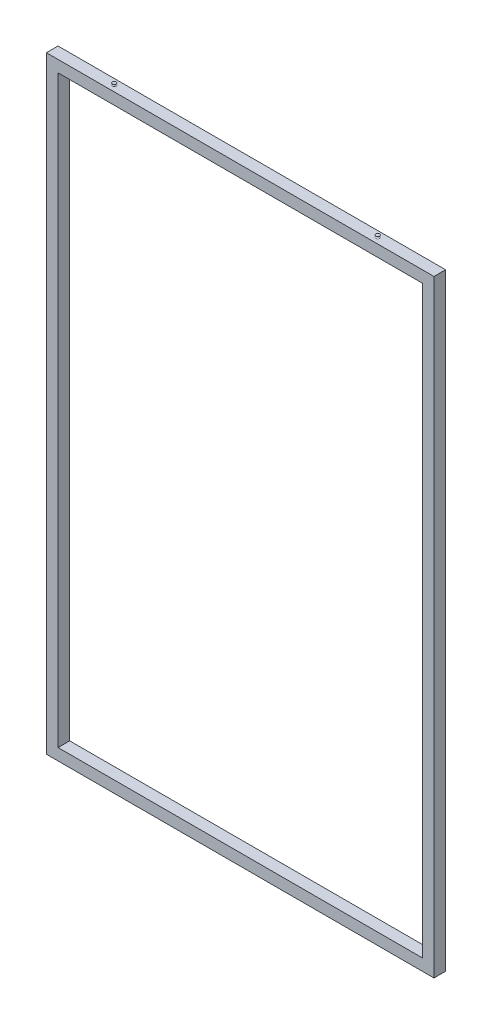
ISO-10303-21;
HEADER;
FILE_DESCRIPTION(('STEP AP214'),'2;1');
FILE_NAME('part.step','',(''),(''),'','','');
FILE_SCHEMA(('AUTOMOTIVE_DESIGN { 1 0 10303 214 1 1 1 1 }'));
ENDSEC;
DATA;
#1=APPLICATION_CONTEXT('core data for automotive mechanical design processes');
#2=APPLICATION_PROTOCOL_DEFINITION('international standard','automotive_design',2000,#1);
#3=PRODUCT_CONTEXT('',#1,'mechanical');
#4=PRODUCT('Part','Part','',(#3));
#5=PRODUCT_RELATED_PRODUCT_CATEGORY('part','',(#4));
#6=PRODUCT_DEFINITION_FORMATION('','',#4);
#7=PRODUCT_DEFINITION_CONTEXT('part definition',#1,'design');
#8=PRODUCT_DEFINITION('design','',#6,#7);
#9=PRODUCT_DEFINITION_SHAPE('','',#8);
#10=(LENGTH_UNIT() NAMED_UNIT(*) SI_UNIT(.MILLI.,.METRE.));
#11=(NAMED_UNIT(*) PLANE_ANGLE_UNIT() SI_UNIT($,.RADIAN.));
#12=(NAMED_UNIT(*) SI_UNIT($,.STERADIAN.) SOLID_ANGLE_UNIT());
#13=UNCERTAINTY_MEASURE_WITH_UNIT(LENGTH_MEASURE(1.E-05),#10,'distance_accuracy_value','');
#14=(GEOMETRIC_REPRESENTATION_CONTEXT(3) GLOBAL_UNCERTAINTY_ASSIGNED_CONTEXT((#13)) GLOBAL_UNIT_ASSIGNED_CONTEXT((#10,
#11,#12)) REPRESENTATION_CONTEXT('',''));
#15=CARTESIAN_POINT('',(0.,0.,0.));
#16=DIRECTION('',(0.,0.,1.));
#17=DIRECTION('',(1.,0.,0.));
#18=AXIS2_PLACEMENT_3D('',#15,#16,#17);
#19=CARTESIAN_POINT('',(0.,0.,15.));
#20=DIRECTION('',(0.,0.,1.));
#21=DIRECTION('',(1.,0.,0.));
#22=AXIS2_PLACEMENT_3D('',#19,#20,#21);
#23=PLANE('',#22);
#24=DIRECTION('',(0.,1.,0.));
#25=VECTOR('',#24,1.);
#26=CARTESIAN_POINT('',(500.,783.875,15.));
#27=LINE('',#26,#25);
#28=CARTESIAN_POINT('',(500.,-783.875,15.));
#29=VERTEX_POINT('',#28);
#30=CARTESIAN_POINT('',(500.,783.875,15.));
#31=VERTEX_POINT('',#30);
#32=EDGE_CURVE('E350',#29,#31,#27,.T.);
#33=ORIENTED_EDGE('',*,*,#32,.T.);
#34=DIRECTION('',(-1.,0.,0.));
#35=VECTOR('',#34,1.);
#36=CARTESIAN_POINT('',(-500.,783.875,15.));
#37=LINE('',#36,#35);
#38=CARTESIAN_POINT('',(-500.,783.875,15.));
#39=VERTEX_POINT('',#38);
#40=EDGE_CURVE('E354',#31,#39,#37,.T.);
#41=ORIENTED_EDGE('',*,*,#40,.T.);
#42=DIRECTION('',(0.,-1.,0.));
#43=VECTOR('',#42,1.);
#44=CARTESIAN_POINT('',(-500.,783.875,15.));
#45=LINE('',#44,#43);
#46=CARTESIAN_POINT('',(-500.,-783.875,15.));
#47=VERTEX_POINT('',#46);
#48=EDGE_CURVE('E358',#39,#47,#45,.T.);
#49=ORIENTED_EDGE('',*,*,#48,.T.);
#50=DIRECTION('',(1.,0.,0.));
#51=VECTOR('',#50,1.);
#52=CARTESIAN_POINT('',(-500.,-783.875,15.));
#53=LINE('',#52,#51);
#54=EDGE_CURVE('E361',#47,#29,#53,.T.);
#55=ORIENTED_EDGE('',*,*,#54,.T.);
#56=EDGE_LOOP('',(#33,#41,#49,#55));
#57=FACE_BOUND('',#56,.T.);
#58=DIRECTION('',(1.,0.,0.));
#59=VECTOR('',#58,1.);
#60=CARTESIAN_POINT('',(-470.,-753.875,15.));
#61=LINE('',#60,#59);
#62=CARTESIAN_POINT('',(-470.,-753.875,15.));
#63=VERTEX_POINT('',#62);
#64=CARTESIAN_POINT('',(470.,-753.875,15.));
#65=VERTEX_POINT('',#64);
#66=EDGE_CURVE('E318',#63,#65,#61,.T.);
#67=ORIENTED_EDGE('',*,*,#66,.F.);
#68=DIRECTION('',(0.,-1.,0.));
#69=VECTOR('',#68,1.);
#70=CARTESIAN_POINT('',(-470.,753.875,15.));
#71=LINE('',#70,#69);
#72=CARTESIAN_POINT('',(-470.,753.875,15.));
#73=VERTEX_POINT('',#72);
#74=EDGE_CURVE('E315',#73,#63,#71,.T.);
#75=ORIENTED_EDGE('',*,*,#74,.F.);
#76=DIRECTION('',(-1.,0.,0.));
#77=VECTOR('',#76,1.);
#78=CARTESIAN_POINT('',(-470.,753.875,15.));
#79=LINE('',#78,#77);
#80=CARTESIAN_POINT('',(470.,753.875,15.));
#81=VERTEX_POINT('',#80);
#82=EDGE_CURVE('E325',#81,#73,#79,.T.);
#83=ORIENTED_EDGE('',*,*,#82,.F.);
#84=DIRECTION('',(0.,1.,0.));
#85=VECTOR('',#84,1.);
#86=CARTESIAN_POINT('',(470.,753.875,15.));
#87=LINE('',#86,#85);
#88=EDGE_CURVE('E322',#65,#81,#87,.T.);
#89=ORIENTED_EDGE('',*,*,#88,.F.);
#90=EDGE_LOOP('',(#67,#75,#83,#89));
#91=FACE_BOUND('',#90,.T.);
#92=ADVANCED_FACE('F42',(#57,#91),#23,.T.);
#93=CARTESIAN_POINT('',(0.,0.,-15.));
#94=DIRECTION('',(0.,0.,1.));
#95=DIRECTION('',(1.,0.,0.));
#96=AXIS2_PLACEMENT_3D('',#93,#94,#95);
#97=PLANE('',#96);
#98=DIRECTION('',(0.,1.,0.));
#99=VECTOR('',#98,1.);
#100=CARTESIAN_POINT('',(500.,783.875,-15.));
#101=LINE('',#100,#99);
#102=CARTESIAN_POINT('',(500.,-783.875,-15.));
#103=VERTEX_POINT('',#102);
#104=CARTESIAN_POINT('',(500.,783.875,-15.));
#105=VERTEX_POINT('',#104);
#106=EDGE_CURVE('E349',#103,#105,#101,.T.);
#107=ORIENTED_EDGE('',*,*,#106,.F.);
#108=DIRECTION('',(1.,0.,0.));
#109=VECTOR('',#108,1.);
#110=CARTESIAN_POINT('',(-500.,-783.875,-15.));
#111=LINE('',#110,#109);
#112=CARTESIAN_POINT('',(-500.,-783.875,-15.));
#113=VERTEX_POINT('',#112);
#114=EDGE_CURVE('E355',#113,#103,#111,.T.);
#115=ORIENTED_EDGE('',*,*,#114,.F.);
#116=DIRECTION('',(0.,-1.,0.));
#117=VECTOR('',#116,1.);
#118=CARTESIAN_POINT('',(-500.,783.875,-15.));
#119=LINE('',#118,#117);
#120=CARTESIAN_POINT('',(-500.,783.875,-15.));
#121=VERTEX_POINT('',#120);
#122=EDGE_CURVE('E371',#121,#113,#119,.T.);
#123=ORIENTED_EDGE('',*,*,#122,.F.);
#124=DIRECTION('',(-1.,0.,0.));
#125=VECTOR('',#124,1.);
#126=CARTESIAN_POINT('',(-500.,783.875,-15.));
#127=LINE('',#126,#125);
#128=EDGE_CURVE('E368',#105,#121,#127,.T.);
#129=ORIENTED_EDGE('',*,*,#128,.F.);
#130=EDGE_LOOP('',(#107,#115,#123,#129));
#131=FACE_BOUND('',#130,.T.);
#132=DIRECTION('',(0.,-1.,0.));
#133=VECTOR('',#132,1.);
#134=CARTESIAN_POINT('',(-470.,753.875,-15.));
#135=LINE('',#134,#133);
#136=CARTESIAN_POINT('',(-470.,753.875,-15.));
#137=VERTEX_POINT('',#136);
#138=CARTESIAN_POINT('',(-470.,-753.875,-15.));
#139=VERTEX_POINT('',#138);
#140=EDGE_CURVE('E66',#137,#139,#135,.T.);
#141=ORIENTED_EDGE('',*,*,#140,.T.);
#142=DIRECTION('',(1.,0.,0.));
#143=VECTOR('',#142,1.);
#144=CARTESIAN_POINT('',(-470.,-753.875,-15.));
#145=LINE('',#144,#143);
#146=CARTESIAN_POINT('',(470.,-753.875,-15.));
#147=VERTEX_POINT('',#146);
#148=EDGE_CURVE('E216',#139,#147,#145,.T.);
#149=ORIENTED_EDGE('',*,*,#148,.T.);
#150=DIRECTION('',(0.,1.,0.));
#151=VECTOR('',#150,1.);
#152=CARTESIAN_POINT('',(470.,753.875,-15.));
#153=LINE('',#152,#151);
#154=CARTESIAN_POINT('',(470.,753.875,-15.));
#155=VERTEX_POINT('',#154);
#156=EDGE_CURVE('E332',#147,#155,#153,.T.);
#157=ORIENTED_EDGE('',*,*,#156,.T.);
#158=DIRECTION('',(-1.,0.,0.));
#159=VECTOR('',#158,1.);
#160=CARTESIAN_POINT('',(-470.,753.875,-15.));
#161=LINE('',#160,#159);
#162=EDGE_CURVE('E319',#155,#137,#161,.T.);
#163=ORIENTED_EDGE('',*,*,#162,.T.);
#164=EDGE_LOOP('',(#141,#149,#157,#163));
#165=FACE_BOUND('',#164,.T.);
#166=ADVANCED_FACE('F394',(#131,#165),#97,.F.);
#167=CARTESIAN_POINT('',(500.,783.875,15.));
#168=DIRECTION('',(-1.,0.,0.));
#169=DIRECTION('',(0.,-1.,0.));
#170=AXIS2_PLACEMENT_3D('',#167,#168,#169);
#171=PLANE('',#170);
#172=ORIENTED_EDGE('',*,*,#106,.T.);
#173=DIRECTION('',(0.,0.,-1.));
#174=VECTOR('',#173,1.);
#175=CARTESIAN_POINT('',(500.,783.875,15.));
#176=LINE('',#175,#174);
#177=EDGE_CURVE('E11',#31,#105,#176,.T.);
#178=ORIENTED_EDGE('',*,*,#177,.F.);
#179=ORIENTED_EDGE('',*,*,#32,.F.);
#180=DIRECTION('',(0.,0.,-1.));
#181=VECTOR('',#180,1.);
#182=CARTESIAN_POINT('',(500.,-783.875,15.));
#183=LINE('',#182,#181);
#184=EDGE_CURVE('E364',#29,#103,#183,.T.);
#185=ORIENTED_EDGE('',*,*,#184,.T.);
#186=EDGE_LOOP('',(#172,#178,#179,#185));
#187=FACE_BOUND('',#186,.T.);
#188=ADVANCED_FACE('F44',(#187),#171,.F.);
#189=CARTESIAN_POINT('',(-500.,783.875,15.));
#190=DIRECTION('',(0.,-1.,0.));
#191=DIRECTION('',(0.,0.,-1.));
#192=AXIS2_PLACEMENT_3D('',#189,#190,#191);
#193=PLANE('',#192);
#194=CARTESIAN_POINT('',(340.,783.875,0.));
#195=DIRECTION('',(0.,1.,0.));
#196=DIRECTION('',(0.,0.,-1.));
#197=AXIS2_PLACEMENT_3D('',#194,#195,#196);
#198=CIRCLE('',#197,5.);
#199=CARTESIAN_POINT('',(340.,783.875,-5.));
#200=VERTEX_POINT('',#199);
#201=EDGE_CURVE('E536',#200,#200,#198,.T.);
#202=ORIENTED_EDGE('',*,*,#201,.F.);
#203=EDGE_LOOP('',(#202));
#204=FACE_BOUND('',#203,.T.);
#205=CARTESIAN_POINT('',(-340.,783.875,0.));
#206=DIRECTION('',(0.,-1.,0.));
#207=DIRECTION('',(0.,0.,-1.));
#208=AXIS2_PLACEMENT_3D('',#205,#206,#207);
#209=CIRCLE('',#208,5.);
#210=CARTESIAN_POINT('',(-340.,783.875,-5.));
#211=VERTEX_POINT('',#210);
#212=EDGE_CURVE('E541',#211,#211,#209,.T.);
#213=ORIENTED_EDGE('',*,*,#212,.T.);
#214=EDGE_LOOP('',(#213));
#215=FACE_BOUND('',#214,.T.);
#216=ORIENTED_EDGE('',*,*,#128,.T.);
#217=DIRECTION('',(0.,0.,-1.));
#218=VECTOR('',#217,1.);
#219=CARTESIAN_POINT('',(-500.,783.875,15.));
#220=LINE('',#219,#218);
#221=EDGE_CURVE('E51',#39,#121,#220,.T.);
#222=ORIENTED_EDGE('',*,*,#221,.F.);
#223=ORIENTED_EDGE('',*,*,#40,.F.);
#224=ORIENTED_EDGE('',*,*,#177,.T.);
#225=EDGE_LOOP('',(#216,#222,#223,#224));
#226=FACE_BOUND('',#225,.T.);
#227=ADVANCED_FACE('F405',(#204,#215,#226),#193,.F.);
#228=CARTESIAN_POINT('',(-500.,783.875,15.));
#229=DIRECTION('',(1.,0.,0.));
#230=DIRECTION('',(0.,1.,0.));
#231=AXIS2_PLACEMENT_3D('',#228,#229,#230);
#232=PLANE('',#231);
#233=ORIENTED_EDGE('',*,*,#122,.T.);
#234=DIRECTION('',(0.,0.,-1.));
#235=VECTOR('',#234,1.);
#236=CARTESIAN_POINT('',(-500.,-783.875,15.));
#237=LINE('',#236,#235);
#238=EDGE_CURVE('E379',#47,#113,#237,.T.);
#239=ORIENTED_EDGE('',*,*,#238,.F.);
#240=ORIENTED_EDGE('',*,*,#48,.F.);
#241=ORIENTED_EDGE('',*,*,#221,.T.);
#242=EDGE_LOOP('',(#233,#239,#240,#241));
#243=FACE_BOUND('',#242,.T.);
#244=ADVANCED_FACE('F388',(#243),#232,.F.);
#245=CARTESIAN_POINT('',(-500.,-783.875,15.));
#246=DIRECTION('',(0.,1.,0.));
#247=DIRECTION('',(0.,0.,1.));
#248=AXIS2_PLACEMENT_3D('',#245,#246,#247);
#249=PLANE('',#248);
#250=ORIENTED_EDGE('',*,*,#114,.T.);
#251=ORIENTED_EDGE('',*,*,#184,.F.);
#252=ORIENTED_EDGE('',*,*,#54,.F.);
#253=ORIENTED_EDGE('',*,*,#238,.T.);
#254=EDGE_LOOP('',(#250,#251,#252,#253));
#255=FACE_BOUND('',#254,.T.);
#256=ADVANCED_FACE('F398',(#255),#249,.F.);
#257=CARTESIAN_POINT('',(-470.,753.875,15.));
#258=DIRECTION('',(1.,0.,0.));
#259=DIRECTION('',(0.,1.,0.));
#260=AXIS2_PLACEMENT_3D('',#257,#258,#259);
#261=PLANE('',#260);
#262=ORIENTED_EDGE('',*,*,#140,.F.);
#263=DIRECTION('',(0.,0.,-1.));
#264=VECTOR('',#263,1.);
#265=CARTESIAN_POINT('',(-470.,753.875,15.));
#266=LINE('',#265,#264);
#267=EDGE_CURVE('E327',#73,#137,#266,.T.);
#268=ORIENTED_EDGE('',*,*,#267,.F.);
#269=ORIENTED_EDGE('',*,*,#74,.T.);
#270=DIRECTION('',(0.,0.,-1.));
#271=VECTOR('',#270,1.);
#272=CARTESIAN_POINT('',(-470.,-753.875,15.));
#273=LINE('',#272,#271);
#274=EDGE_CURVE('E346',#63,#139,#273,.T.);
#275=ORIENTED_EDGE('',*,*,#274,.T.);
#276=EDGE_LOOP('',(#262,#268,#269,#275));
#277=FACE_BOUND('',#276,.T.);
#278=ADVANCED_FACE('F422',(#277),#261,.T.);
#279=CARTESIAN_POINT('',(-470.,-753.875,15.));
#280=DIRECTION('',(0.,1.,0.));
#281=DIRECTION('',(0.,0.,1.));
#282=AXIS2_PLACEMENT_3D('',#279,#280,#281);
#283=PLANE('',#282);
#284=ORIENTED_EDGE('',*,*,#148,.F.);
#285=ORIENTED_EDGE('',*,*,#274,.F.);
#286=ORIENTED_EDGE('',*,*,#66,.T.);
#287=DIRECTION('',(0.,0.,-1.));
#288=VECTOR('',#287,1.);
#289=CARTESIAN_POINT('',(470.,-753.875,15.));
#290=LINE('',#289,#288);
#291=EDGE_CURVE('E343',#65,#147,#290,.T.);
#292=ORIENTED_EDGE('',*,*,#291,.T.);
#293=EDGE_LOOP('',(#284,#285,#286,#292));
#294=FACE_BOUND('',#293,.T.);
#295=ADVANCED_FACE('F429',(#294),#283,.T.);
#296=CARTESIAN_POINT('',(470.,753.875,15.));
#297=DIRECTION('',(-1.,0.,0.));
#298=DIRECTION('',(0.,-1.,0.));
#299=AXIS2_PLACEMENT_3D('',#296,#297,#298);
#300=PLANE('',#299);
#301=ORIENTED_EDGE('',*,*,#156,.F.);
#302=ORIENTED_EDGE('',*,*,#291,.F.);
#303=ORIENTED_EDGE('',*,*,#88,.T.);
#304=DIRECTION('',(0.,0.,-1.));
#305=VECTOR('',#304,1.);
#306=CARTESIAN_POINT('',(470.,753.875,15.));
#307=LINE('',#306,#305);
#308=EDGE_CURVE('E58',#81,#155,#307,.T.);
#309=ORIENTED_EDGE('',*,*,#308,.T.);
#310=EDGE_LOOP('',(#301,#302,#303,#309));
#311=FACE_BOUND('',#310,.T.);
#312=ADVANCED_FACE('F433',(#311),#300,.T.);
#313=CARTESIAN_POINT('',(-470.,753.875,15.));
#314=DIRECTION('',(0.,-1.,0.));
#315=DIRECTION('',(0.,0.,-1.));
#316=AXIS2_PLACEMENT_3D('',#313,#314,#315);
#317=PLANE('',#316);
#318=ORIENTED_EDGE('',*,*,#162,.F.);
#319=ORIENTED_EDGE('',*,*,#308,.F.);
#320=ORIENTED_EDGE('',*,*,#82,.T.);
#321=ORIENTED_EDGE('',*,*,#267,.T.);
#322=EDGE_LOOP('',(#318,#319,#320,#321));
#323=FACE_BOUND('',#322,.T.);
#324=ADVANCED_FACE('F438',(#323),#317,.T.);
#325=CARTESIAN_POINT('',(-345.,788.875,0.));
#326=DIRECTION('',(0.,-1.,0.));
#327=DIRECTION('',(0.,0.,-1.));
#328=AXIS2_PLACEMENT_3D('',#325,#326,#327);
#329=PLANE('',#328);
#330=CARTESIAN_POINT('',(-340.,788.875,0.));
#331=DIRECTION('',(0.,-1.,0.));
#332=DIRECTION('',(0.,0.,-1.));
#333=AXIS2_PLACEMENT_3D('',#330,#331,#332);
#334=CIRCLE('',#333,5.);
#335=CARTESIAN_POINT('',(-340.,788.875,-5.));
#336=VERTEX_POINT('',#335);
#337=EDGE_CURVE('E304',#336,#336,#334,.T.);
#338=ORIENTED_EDGE('',*,*,#337,.F.);
#339=EDGE_LOOP('',(#338));
#340=FACE_BOUND('',#339,.T.);
#341=ADVANCED_FACE('F444',(#340),#329,.F.);
#342=CARTESIAN_POINT('',(-340.,786.375,0.));
#343=DIRECTION('',(0.,-1.,0.));
#344=DIRECTION('',(0.,0.,-1.));
#345=AXIS2_PLACEMENT_3D('',#342,#343,#344);
#346=TOROIDAL_SURFACE('',#345,5.,2.49999999999995);
#347=ORIENTED_EDGE('',*,*,#212,.F.);
#348=EDGE_LOOP('',(#347));
#349=FACE_BOUND('',#348,.T.);
#350=ORIENTED_EDGE('',*,*,#337,.T.);
#351=EDGE_LOOP('',(#350));
#352=FACE_BOUND('',#351,.T.);
#353=ADVANCED_FACE('F520',(#349,#352),#346,.F.);
#354=CARTESIAN_POINT('',(345.,788.875,0.));
#355=DIRECTION('',(0.,-1.,0.));
#356=DIRECTION('',(0.,0.,-1.));
#357=AXIS2_PLACEMENT_3D('',#354,#355,#356);
#358=PLANE('',#357);
#359=CARTESIAN_POINT('',(340.,788.875,0.));
#360=DIRECTION('',(0.,1.,0.));
#361=DIRECTION('',(0.,0.,-1.));
#362=AXIS2_PLACEMENT_3D('',#359,#360,#361);
#363=CIRCLE('',#362,5.);
#364=CARTESIAN_POINT('',(340.,788.875,-5.));
#365=VERTEX_POINT('',#364);
#366=EDGE_CURVE('E539',#365,#365,#363,.T.);
#367=ORIENTED_EDGE('',*,*,#366,.T.);
#368=EDGE_LOOP('',(#367));
#369=FACE_BOUND('',#368,.T.);
#370=ADVANCED_FACE('F524',(#369),#358,.F.);
#371=CARTESIAN_POINT('',(340.,786.375,0.));
#372=DIRECTION('',(0.,-1.,0.));
#373=DIRECTION('',(0.,0.,-1.));
#374=AXIS2_PLACEMENT_3D('',#371,#372,#373);
#375=TOROIDAL_SURFACE('',#374,5.,2.49999999999995);
#376=ORIENTED_EDGE('',*,*,#201,.T.);
#377=EDGE_LOOP('',(#376));
#378=FACE_BOUND('',#377,.T.);
#379=ORIENTED_EDGE('',*,*,#366,.F.);
#380=EDGE_LOOP('',(#379));
#381=FACE_BOUND('',#380,.T.);
#382=ADVANCED_FACE('F528',(#378,#381),#375,.F.);
#383=CLOSED_SHELL('',(#92,#166,#188,#227,#244,#256,#278,#295,#312,#324,#341,#353,#370,#382));
#384=CARTESIAN_POINT('',(-498.,-783.275,13.));
#385=DIRECTION('',(0.,0.,1.));
#386=DIRECTION('',(1.,0.,0.));
#387=AXIS2_PLACEMENT_3D('',#384,#385,#386);
#388=PLANE('',#387);
#389=DIRECTION('',(0.,1.,0.));
#390=VECTOR('',#389,1.);
#391=CARTESIAN_POINT('',(-472.,-783.275,13.));
#392=LINE('',#391,#390);
#393=CARTESIAN_POINT('',(-472.,-755.875,13.));
#394=VERTEX_POINT('',#393);
#395=CARTESIAN_POINT('',(-472.,755.875,13.));
#396=VERTEX_POINT('',#395);
#397=EDGE_CURVE('E258',#394,#396,#392,.T.);
#398=ORIENTED_EDGE('',*,*,#397,.F.);
#399=DIRECTION('',(-0.707106781186547,-0.707106781186548,0.));
#400=VECTOR('',#399,1.);
#401=CARTESIAN_POINT('',(0.7000000000002,-283.175,12.9999999999999));
#402=LINE('',#401,#400);
#403=CARTESIAN_POINT('',(-498.,-781.875,13.));
#404=VERTEX_POINT('',#403);
#405=EDGE_CURVE('E229',#394,#404,#402,.T.);
#406=ORIENTED_EDGE('',*,*,#405,.T.);
#407=DIRECTION('',(0.,1.,0.));
#408=VECTOR('',#407,1.);
#409=CARTESIAN_POINT('',(-498.,-783.275,13.));
#410=LINE('',#409,#408);
#411=CARTESIAN_POINT('',(-498.,781.875,13.));
#412=VERTEX_POINT('',#411);
#413=EDGE_CURVE('E299',#404,#412,#410,.T.);
#414=ORIENTED_EDGE('',*,*,#413,.T.);
#415=DIRECTION('',(-0.707106781186548,0.707106781186547,0.));
#416=VECTOR('',#415,1.);
#417=CARTESIAN_POINT('',(-498.7,782.575,13.));
#418=LINE('',#417,#416);
#419=EDGE_CURVE('E269',#396,#412,#418,.T.);
#420=ORIENTED_EDGE('',*,*,#419,.F.);
#421=EDGE_LOOP('',(#398,#406,#414,#420));
#422=FACE_BOUND('',#421,.T.);
#423=ADVANCED_FACE('F445',(#422),#388,.F.);
#424=CARTESIAN_POINT('',(-498.,-783.275,13.));
#425=DIRECTION('',(-1.,0.,0.));
#426=DIRECTION('',(0.,-1.,0.));
#427=AXIS2_PLACEMENT_3D('',#424,#425,#426);
#428=PLANE('',#427);
#429=ORIENTED_EDGE('',*,*,#413,.F.);
#430=DIRECTION('',(0.,0.,-1.));
#431=VECTOR('',#430,1.);
#432=CARTESIAN_POINT('',(-498.,-781.875,13.));
#433=LINE('',#432,#431);
#434=CARTESIAN_POINT('',(-498.,-781.875,-13.));
#435=VERTEX_POINT('',#434);
#436=EDGE_CURVE('E225',#404,#435,#433,.T.);
#437=ORIENTED_EDGE('',*,*,#436,.T.);
#438=DIRECTION('',(0.,1.,0.));
#439=VECTOR('',#438,1.);
#440=CARTESIAN_POINT('',(-498.,-783.275,-13.));
#441=LINE('',#440,#439);
#442=CARTESIAN_POINT('',(-498.,781.875,-13.));
#443=VERTEX_POINT('',#442);
#444=EDGE_CURVE('E303',#435,#443,#441,.T.);
#445=ORIENTED_EDGE('',*,*,#444,.T.);
#446=DIRECTION('',(0.,0.,-1.));
#447=VECTOR('',#446,1.);
#448=CARTESIAN_POINT('',(-498.,781.875,13.));
#449=LINE('',#448,#447);
#450=EDGE_CURVE('E272',#412,#443,#449,.T.);
#451=ORIENTED_EDGE('',*,*,#450,.F.);
#452=EDGE_LOOP('',(#429,#437,#445,#451));
#453=FACE_BOUND('',#452,.T.);
#454=ADVANCED_FACE('F448',(#453),#428,.F.);
#455=CARTESIAN_POINT('',(-498.,-783.275,-13.));
#456=DIRECTION('',(0.,0.,-1.));
#457=DIRECTION('',(-1.,0.,0.));
#458=AXIS2_PLACEMENT_3D('',#455,#456,#457);
#459=PLANE('',#458);
#460=ORIENTED_EDGE('',*,*,#444,.F.);
#461=DIRECTION('',(0.707106781186547,0.707106781186548,0.));
#462=VECTOR('',#461,1.);
#463=CARTESIAN_POINT('',(0.7000000000002,-283.175,-13.));
#464=LINE('',#463,#462);
#465=CARTESIAN_POINT('',(-472.,-755.875,-13.));
#466=VERTEX_POINT('',#465);
#467=EDGE_CURVE('E206',#435,#466,#464,.T.);
#468=ORIENTED_EDGE('',*,*,#467,.T.);
#469=DIRECTION('',(0.,1.,0.));
#470=VECTOR('',#469,1.);
#471=CARTESIAN_POINT('',(-472.,-783.275,-13.));
#472=LINE('',#471,#470);
#473=CARTESIAN_POINT('',(-472.,755.875,-13.));
#474=VERTEX_POINT('',#473);
#475=EDGE_CURVE('E308',#466,#474,#472,.T.);
#476=ORIENTED_EDGE('',*,*,#475,.T.);
#477=DIRECTION('',(0.707106781186548,-0.707106781186547,0.));
#478=VECTOR('',#477,1.);
#479=CARTESIAN_POINT('',(-498.7,782.575,-13.));
#480=LINE('',#479,#478);
#481=EDGE_CURVE('E275',#443,#474,#480,.T.);
#482=ORIENTED_EDGE('',*,*,#481,.F.);
#483=EDGE_LOOP('',(#460,#468,#476,#482));
#484=FACE_BOUND('',#483,.T.);
#485=ADVANCED_FACE('F453',(#484),#459,.F.);
#486=CARTESIAN_POINT('',(-472.,-783.275,13.));
#487=DIRECTION('',(1.,0.,0.));
#488=DIRECTION('',(0.,1.,0.));
#489=AXIS2_PLACEMENT_3D('',#486,#487,#488);
#490=PLANE('',#489);
#491=ORIENTED_EDGE('',*,*,#475,.F.);
#492=DIRECTION('',(0.,0.,1.));
#493=VECTOR('',#492,1.);
#494=CARTESIAN_POINT('',(-472.,-755.875,13.));
#495=LINE('',#494,#493);
#496=EDGE_CURVE('E233',#466,#394,#495,.T.);
#497=ORIENTED_EDGE('',*,*,#496,.T.);
#498=ORIENTED_EDGE('',*,*,#397,.T.);
#499=DIRECTION('',(0.,0.,1.));
#500=VECTOR('',#499,1.);
#501=CARTESIAN_POINT('',(-472.,755.875,13.));
#502=LINE('',#501,#500);
#503=EDGE_CURVE('E239',#474,#396,#502,.T.);
#504=ORIENTED_EDGE('',*,*,#503,.F.);
#505=EDGE_LOOP('',(#491,#497,#498,#504));
#506=FACE_BOUND('',#505,.T.);
#507=ADVANCED_FACE('F457',(#506),#490,.F.);
#508=CARTESIAN_POINT('',(-499.4,755.875,13.));
#509=DIRECTION('',(0.,-1.,0.));
#510=DIRECTION('',(1.,0.,0.));
#511=AXIS2_PLACEMENT_3D('',#508,#509,#510);
#512=PLANE('',#511);
#513=ORIENTED_EDGE('',*,*,#503,.T.);
#514=DIRECTION('',(1.,0.,0.));
#515=VECTOR('',#514,1.);
#516=CARTESIAN_POINT('',(-499.4,755.875,13.));
#517=LINE('',#516,#515);
#518=CARTESIAN_POINT('',(0.,755.875,13.));
#519=VERTEX_POINT('',#518);
#520=EDGE_CURVE('E254',#396,#519,#517,.T.);
#521=ORIENTED_EDGE('',*,*,#520,.T.);
#522=DIRECTION('',(0.,0.,-1.));
#523=VECTOR('',#522,1.);
#524=CARTESIAN_POINT('',(0.,755.875,13.));
#525=LINE('',#524,#523);
#526=CARTESIAN_POINT('',(0.,755.875,-13.));
#527=VERTEX_POINT('',#526);
#528=EDGE_CURVE('E190',#519,#527,#525,.T.);
#529=ORIENTED_EDGE('',*,*,#528,.T.);
#530=DIRECTION('',(1.,0.,0.));
#531=VECTOR('',#530,1.);
#532=CARTESIAN_POINT('',(-499.4,755.875,-13.));
#533=LINE('',#532,#531);
#534=EDGE_CURVE('E257',#474,#527,#533,.T.);
#535=ORIENTED_EDGE('',*,*,#534,.F.);
#536=EDGE_LOOP('',(#513,#521,#529,#535));
#537=FACE_BOUND('',#536,.T.);
#538=ADVANCED_FACE('F461',(#537),#512,.F.);
#539=CARTESIAN_POINT('',(-499.4,781.875,-13.));
#540=DIRECTION('',(0.,0.,-1.));
#541=DIRECTION('',(-1.,0.,0.));
#542=AXIS2_PLACEMENT_3D('',#539,#540,#541);
#543=PLANE('',#542);
#544=ORIENTED_EDGE('',*,*,#481,.T.);
#545=ORIENTED_EDGE('',*,*,#534,.T.);
#546=DIRECTION('',(0.,1.,0.));
#547=VECTOR('',#546,1.);
#548=CARTESIAN_POINT('',(0.,781.875,-13.));
#549=LINE('',#548,#547);
#550=CARTESIAN_POINT('',(0.,781.875,-13.));
#551=VERTEX_POINT('',#550);
#552=EDGE_CURVE('E280',#527,#551,#549,.T.);
#553=ORIENTED_EDGE('',*,*,#552,.T.);
#554=DIRECTION('',(1.,0.,0.));
#555=VECTOR('',#554,1.);
#556=CARTESIAN_POINT('',(-499.4,781.875,-13.));
#557=LINE('',#556,#555);
#558=EDGE_CURVE('E261',#443,#551,#557,.T.);
#559=ORIENTED_EDGE('',*,*,#558,.F.);
#560=EDGE_LOOP('',(#544,#545,#553,#559));
#561=FACE_BOUND('',#560,.T.);
#562=ADVANCED_FACE('F479',(#561),#543,.F.);
#563=CARTESIAN_POINT('',(-499.4,781.875,13.));
#564=DIRECTION('',(0.,1.,0.));
#565=DIRECTION('',(-1.,0.,0.));
#566=AXIS2_PLACEMENT_3D('',#563,#564,#565);
#567=PLANE('',#566);
#568=ORIENTED_EDGE('',*,*,#450,.T.);
#569=ORIENTED_EDGE('',*,*,#558,.T.);
#570=DIRECTION('',(0.,0.,1.));
#571=VECTOR('',#570,1.);
#572=CARTESIAN_POINT('',(0.,781.875,13.));
#573=LINE('',#572,#571);
#574=CARTESIAN_POINT('',(0.,781.875,13.));
#575=VERTEX_POINT('',#574);
#576=EDGE_CURVE('E284',#551,#575,#573,.T.);
#577=ORIENTED_EDGE('',*,*,#576,.T.);
#578=DIRECTION('',(1.,0.,0.));
#579=VECTOR('',#578,1.);
#580=CARTESIAN_POINT('',(-499.4,781.875,13.));
#581=LINE('',#580,#579);
#582=EDGE_CURVE('E264',#412,#575,#581,.T.);
#583=ORIENTED_EDGE('',*,*,#582,.F.);
#584=EDGE_LOOP('',(#568,#569,#577,#583));
#585=FACE_BOUND('',#584,.T.);
#586=ADVANCED_FACE('F483',(#585),#567,.F.);
#587=CARTESIAN_POINT('',(-499.4,781.875,13.));
#588=DIRECTION('',(0.,0.,1.));
#589=DIRECTION('',(0.,-1.,0.));
#590=AXIS2_PLACEMENT_3D('',#587,#588,#589);
#591=PLANE('',#590);
#592=ORIENTED_EDGE('',*,*,#419,.T.);
#593=ORIENTED_EDGE('',*,*,#582,.T.);
#594=DIRECTION('',(0.,-1.,0.));
#595=VECTOR('',#594,1.);
#596=CARTESIAN_POINT('',(0.,781.875,13.));
#597=LINE('',#596,#595);
#598=EDGE_CURVE('E196',#575,#519,#597,.T.);
#599=ORIENTED_EDGE('',*,*,#598,.T.);
#600=ORIENTED_EDGE('',*,*,#520,.F.);
#601=EDGE_LOOP('',(#592,#593,#599,#600));
#602=FACE_BOUND('',#601,.T.);
#603=ADVANCED_FACE('F476',(#602),#591,.F.);
#604=CARTESIAN_POINT('',(0.,755.875,13.));
#605=DIRECTION('',(0.,-1.,0.));
#606=DIRECTION('',(1.,0.,0.));
#607=AXIS2_PLACEMENT_3D('',#604,#605,#606);
#608=PLANE('',#607);
#609=DIRECTION('',(1.,0.,0.));
#610=VECTOR('',#609,1.);
#611=CARTESIAN_POINT('',(0.,755.875,-13.));
#612=LINE('',#611,#610);
#613=CARTESIAN_POINT('',(472.,755.875,-13.));
#614=VERTEX_POINT('',#613);
#615=EDGE_CURVE('E195',#527,#614,#612,.T.);
#616=ORIENTED_EDGE('',*,*,#615,.F.);
#617=ORIENTED_EDGE('',*,*,#528,.F.);
#618=DIRECTION('',(1.,0.,0.));
#619=VECTOR('',#618,1.);
#620=CARTESIAN_POINT('',(0.,755.875,13.));
#621=LINE('',#620,#619);
#622=CARTESIAN_POINT('',(472.,755.875,13.));
#623=VERTEX_POINT('',#622);
#624=EDGE_CURVE('E186',#519,#623,#621,.T.);
#625=ORIENTED_EDGE('',*,*,#624,.T.);
#626=DIRECTION('',(0.,0.,1.));
#627=VECTOR('',#626,1.);
#628=CARTESIAN_POINT('',(472.,755.875,13.));
#629=LINE('',#628,#627);
#630=EDGE_CURVE('E171',#614,#623,#629,.T.);
#631=ORIENTED_EDGE('',*,*,#630,.F.);
#632=EDGE_LOOP('',(#616,#617,#625,#631));
#633=FACE_BOUND('',#632,.T.);
#634=ADVANCED_FACE('F188',(#633),#608,.F.);
#635=CARTESIAN_POINT('',(0.,781.875,-13.));
#636=DIRECTION('',(0.,0.,-1.));
#637=DIRECTION('',(-1.,0.,0.));
#638=AXIS2_PLACEMENT_3D('',#635,#636,#637);
#639=PLANE('',#638);
#640=DIRECTION('',(1.,0.,0.));
#641=VECTOR('',#640,1.);
#642=CARTESIAN_POINT('',(0.,781.875,-13.));
#643=LINE('',#642,#641);
#644=CARTESIAN_POINT('',(498.,781.875,-13.));
#645=VERTEX_POINT('',#644);
#646=EDGE_CURVE('E293',#551,#645,#643,.T.);
#647=ORIENTED_EDGE('',*,*,#646,.F.);
#648=ORIENTED_EDGE('',*,*,#552,.F.);
#649=ORIENTED_EDGE('',*,*,#615,.T.);
#650=DIRECTION('',(-0.707106781186547,-0.707106781186548,0.));
#651=VECTOR('',#650,1.);
#652=CARTESIAN_POINT('',(498.7,782.575,-13.));
#653=LINE('',#652,#651);
#654=EDGE_CURVE('E181',#645,#614,#653,.T.);
#655=ORIENTED_EDGE('',*,*,#654,.F.);
#656=EDGE_LOOP('',(#647,#648,#649,#655));
#657=FACE_BOUND('',#656,.T.);
#658=ADVANCED_FACE('F469',(#657),#639,.F.);
#659=CARTESIAN_POINT('',(0.,781.875,13.));
#660=DIRECTION('',(0.,1.,0.));
#661=DIRECTION('',(-1.,0.,0.));
#662=AXIS2_PLACEMENT_3D('',#659,#660,#661);
#663=PLANE('',#662);
#664=DIRECTION('',(1.,0.,0.));
#665=VECTOR('',#664,1.);
#666=CARTESIAN_POINT('',(0.,781.875,13.));
#667=LINE('',#666,#665);
#668=CARTESIAN_POINT('',(498.,781.875,13.));
#669=VERTEX_POINT('',#668);
#670=EDGE_CURVE('E201',#575,#669,#667,.T.);
#671=ORIENTED_EDGE('',*,*,#670,.F.);
#672=ORIENTED_EDGE('',*,*,#576,.F.);
#673=ORIENTED_EDGE('',*,*,#646,.T.);
#674=DIRECTION('',(0.,0.,-1.));
#675=VECTOR('',#674,1.);
#676=CARTESIAN_POINT('',(498.,781.875,13.));
#677=LINE('',#676,#675);
#678=EDGE_CURVE('E566',#669,#645,#677,.T.);
#679=ORIENTED_EDGE('',*,*,#678,.F.);
#680=EDGE_LOOP('',(#671,#672,#673,#679));
#681=FACE_BOUND('',#680,.T.);
#682=ADVANCED_FACE('F466',(#681),#663,.F.);
#683=CARTESIAN_POINT('',(0.,781.875,13.));
#684=DIRECTION('',(0.,0.,1.));
#685=DIRECTION('',(0.,-1.,0.));
#686=AXIS2_PLACEMENT_3D('',#683,#684,#685);
#687=PLANE('',#686);
#688=ORIENTED_EDGE('',*,*,#624,.F.);
#689=ORIENTED_EDGE('',*,*,#598,.F.);
#690=ORIENTED_EDGE('',*,*,#670,.T.);
#691=DIRECTION('',(0.707106781186547,0.707106781186548,0.));
#692=VECTOR('',#691,1.);
#693=CARTESIAN_POINT('',(498.7,782.575,13.));
#694=LINE('',#693,#692);
#695=EDGE_CURVE('E182',#623,#669,#694,.T.);
#696=ORIENTED_EDGE('',*,*,#695,.F.);
#697=EDGE_LOOP('',(#688,#689,#690,#696));
#698=FACE_BOUND('',#697,.T.);
#699=ADVANCED_FACE('F199',(#698),#687,.F.);
#700=CARTESIAN_POINT('',(499.4,-781.875,13.));
#701=DIRECTION('',(0.,0.,1.));
#702=DIRECTION('',(0.,-1.,0.));
#703=AXIS2_PLACEMENT_3D('',#700,#701,#702);
#704=PLANE('',#703);
#705=DIRECTION('',(-1.,0.,0.));
#706=VECTOR('',#705,1.);
#707=CARTESIAN_POINT('',(499.4,-755.875,13.));
#708=LINE('',#707,#706);
#709=CARTESIAN_POINT('',(472.,-755.875,13.));
#710=VERTEX_POINT('',#709);
#711=EDGE_CURVE('E247',#710,#394,#708,.T.);
#712=ORIENTED_EDGE('',*,*,#711,.F.);
#713=DIRECTION('',(0.707106781186548,-0.707106781186547,0.));
#714=VECTOR('',#713,1.);
#715=CARTESIAN_POINT('',(-284.575,0.699999999999923,12.9999999999999));
#716=LINE('',#715,#714);
#717=CARTESIAN_POINT('',(498.,-781.875,13.));
#718=VERTEX_POINT('',#717);
#719=EDGE_CURVE('E210',#710,#718,#716,.T.);
#720=ORIENTED_EDGE('',*,*,#719,.T.);
#721=DIRECTION('',(-1.,0.,0.));
#722=VECTOR('',#721,1.);
#723=CARTESIAN_POINT('',(499.4,-781.875,13.));
#724=LINE('',#723,#722);
#725=EDGE_CURVE('E234',#718,#404,#724,.T.);
#726=ORIENTED_EDGE('',*,*,#725,.T.);
#727=ORIENTED_EDGE('',*,*,#405,.F.);
#728=EDGE_LOOP('',(#712,#720,#726,#727));
#729=FACE_BOUND('',#728,.T.);
#730=ADVANCED_FACE('F465',(#729),#704,.F.);
#731=CARTESIAN_POINT('',(499.4,-781.875,13.));
#732=DIRECTION('',(0.,-1.,0.));
#733=DIRECTION('',(1.,0.,0.));
#734=AXIS2_PLACEMENT_3D('',#731,#732,#733);
#735=PLANE('',#734);
#736=ORIENTED_EDGE('',*,*,#725,.F.);
#737=DIRECTION('',(0.,0.,-1.));
#738=VECTOR('',#737,1.);
#739=CARTESIAN_POINT('',(498.,-781.875,13.));
#740=LINE('',#739,#738);
#741=CARTESIAN_POINT('',(498.,-781.875,-13.));
#742=VERTEX_POINT('',#741);
#743=EDGE_CURVE('E559',#718,#742,#740,.T.);
#744=ORIENTED_EDGE('',*,*,#743,.T.);
#745=DIRECTION('',(-1.,0.,0.));
#746=VECTOR('',#745,1.);
#747=CARTESIAN_POINT('',(499.4,-781.875,-13.));
#748=LINE('',#747,#746);
#749=EDGE_CURVE('E238',#742,#435,#748,.T.);
#750=ORIENTED_EDGE('',*,*,#749,.T.);
#751=ORIENTED_EDGE('',*,*,#436,.F.);
#752=EDGE_LOOP('',(#736,#744,#750,#751));
#753=FACE_BOUND('',#752,.T.);
#754=ADVANCED_FACE('F493',(#753),#735,.F.);
#755=CARTESIAN_POINT('',(499.4,-781.875,-13.));
#756=DIRECTION('',(0.,0.,-1.));
#757=DIRECTION('',(-1.,0.,0.));
#758=AXIS2_PLACEMENT_3D('',#755,#756,#757);
#759=PLANE('',#758);
#760=ORIENTED_EDGE('',*,*,#749,.F.);
#761=DIRECTION('',(-0.707106781186548,0.707106781186547,0.));
#762=VECTOR('',#761,1.);
#763=CARTESIAN_POINT('',(-284.575,0.699999999999923,-13.));
#764=LINE('',#763,#762);
#765=CARTESIAN_POINT('',(472.,-755.875,-13.));
#766=VERTEX_POINT('',#765);
#767=EDGE_CURVE('E563',#742,#766,#764,.T.);
#768=ORIENTED_EDGE('',*,*,#767,.T.);
#769=DIRECTION('',(-1.,0.,0.));
#770=VECTOR('',#769,1.);
#771=CARTESIAN_POINT('',(499.4,-755.875,-13.));
#772=LINE('',#771,#770);
#773=EDGE_CURVE('E243',#766,#466,#772,.T.);
#774=ORIENTED_EDGE('',*,*,#773,.T.);
#775=ORIENTED_EDGE('',*,*,#467,.F.);
#776=EDGE_LOOP('',(#760,#768,#774,#775));
#777=FACE_BOUND('',#776,.T.);
#778=ADVANCED_FACE('F497',(#777),#759,.F.);
#779=CARTESIAN_POINT('',(499.4,-755.875,13.));
#780=DIRECTION('',(0.,1.,0.));
#781=DIRECTION('',(-1.,0.,0.));
#782=AXIS2_PLACEMENT_3D('',#779,#780,#781);
#783=PLANE('',#782);
#784=ORIENTED_EDGE('',*,*,#773,.F.);
#785=DIRECTION('',(0.,0.,1.));
#786=VECTOR('',#785,1.);
#787=CARTESIAN_POINT('',(472.,-755.875,13.));
#788=LINE('',#787,#786);
#789=EDGE_CURVE('E552',#766,#710,#788,.T.);
#790=ORIENTED_EDGE('',*,*,#789,.T.);
#791=ORIENTED_EDGE('',*,*,#711,.T.);
#792=ORIENTED_EDGE('',*,*,#496,.F.);
#793=EDGE_LOOP('',(#784,#790,#791,#792));
#794=FACE_BOUND('',#793,.T.);
#795=ADVANCED_FACE('F501',(#794),#783,.F.);
#796=CARTESIAN_POINT('',(498.,783.275,13.));
#797=DIRECTION('',(0.,0.,1.));
#798=DIRECTION('',(1.,0.,0.));
#799=AXIS2_PLACEMENT_3D('',#796,#797,#798);
#800=PLANE('',#799);
#801=ORIENTED_EDGE('',*,*,#695,.T.);
#802=DIRECTION('',(0.,-1.,0.));
#803=VECTOR('',#802,1.);
#804=CARTESIAN_POINT('',(498.,783.275,13.));
#805=LINE('',#804,#803);
#806=EDGE_CURVE('E556',#669,#718,#805,.T.);
#807=ORIENTED_EDGE('',*,*,#806,.T.);
#808=ORIENTED_EDGE('',*,*,#719,.F.);
#809=DIRECTION('',(0.,-1.,0.));
#810=VECTOR('',#809,1.);
#811=CARTESIAN_POINT('',(472.,783.275,13.));
#812=LINE('',#811,#810);
#813=EDGE_CURVE('E175',#623,#710,#812,.T.);
#814=ORIENTED_EDGE('',*,*,#813,.F.);
#815=EDGE_LOOP('',(#801,#807,#808,#814));
#816=FACE_BOUND('',#815,.T.);
#817=ADVANCED_FACE('F208',(#816),#800,.F.);
#818=CARTESIAN_POINT('',(498.,783.275,13.));
#819=DIRECTION('',(1.,0.,0.));
#820=DIRECTION('',(0.,0.,-1.));
#821=AXIS2_PLACEMENT_3D('',#818,#819,#820);
#822=PLANE('',#821);
#823=ORIENTED_EDGE('',*,*,#678,.T.);
#824=DIRECTION('',(0.,-1.,0.));
#825=VECTOR('',#824,1.);
#826=CARTESIAN_POINT('',(498.,783.275,-13.));
#827=LINE('',#826,#825);
#828=EDGE_CURVE('E218',#645,#742,#827,.T.);
#829=ORIENTED_EDGE('',*,*,#828,.T.);
#830=ORIENTED_EDGE('',*,*,#743,.F.);
#831=ORIENTED_EDGE('',*,*,#806,.F.);
#832=EDGE_LOOP('',(#823,#829,#830,#831));
#833=FACE_BOUND('',#832,.T.);
#834=ADVANCED_FACE('F511',(#833),#822,.F.);
#835=CARTESIAN_POINT('',(498.,783.275,-13.));
#836=DIRECTION('',(0.,0.,-1.));
#837=DIRECTION('',(-1.,0.,0.));
#838=AXIS2_PLACEMENT_3D('',#835,#836,#837);
#839=PLANE('',#838);
#840=ORIENTED_EDGE('',*,*,#654,.T.);
#841=DIRECTION('',(0.,-1.,0.));
#842=VECTOR('',#841,1.);
#843=CARTESIAN_POINT('',(472.,783.275,-13.));
#844=LINE('',#843,#842);
#845=EDGE_CURVE('E177',#614,#766,#844,.T.);
#846=ORIENTED_EDGE('',*,*,#845,.T.);
#847=ORIENTED_EDGE('',*,*,#767,.F.);
#848=ORIENTED_EDGE('',*,*,#828,.F.);
#849=EDGE_LOOP('',(#840,#846,#847,#848));
#850=FACE_BOUND('',#849,.T.);
#851=ADVANCED_FACE('F508',(#850),#839,.F.);
#852=CARTESIAN_POINT('',(472.,783.275,13.));
#853=DIRECTION('',(-1.,0.,0.));
#854=DIRECTION('',(0.,0.,1.));
#855=AXIS2_PLACEMENT_3D('',#852,#853,#854);
#856=PLANE('',#855);
#857=ORIENTED_EDGE('',*,*,#630,.T.);
#858=ORIENTED_EDGE('',*,*,#813,.T.);
#859=ORIENTED_EDGE('',*,*,#789,.F.);
#860=ORIENTED_EDGE('',*,*,#845,.F.);
#861=EDGE_LOOP('',(#857,#858,#859,#860));
#862=FACE_BOUND('',#861,.T.);
#863=ADVANCED_FACE('F173',(#862),#856,.F.);
#864=CLOSED_SHELL('',(#423,#454,#485,#507,#538,#562,#586,#603,#634,#658,#682,#699,#730,#754,
#778,#795,#817,#834,#851,#863));
#865=ORIENTED_CLOSED_SHELL('',*,#864,.T.);
#866=BREP_WITH_VOIDS('B2',#383,(#865));
#867=ADVANCED_BREP_SHAPE_REPRESENTATION('',(#18,#866),#14);
#868=SHAPE_DEFINITION_REPRESENTATION(#9,#867);
ENDSEC;
END-ISO-10303-21;
